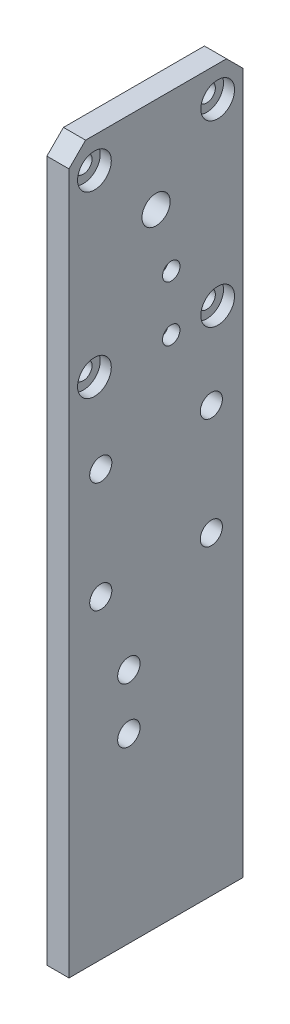
ISO-10303-21;
HEADER;
FILE_DESCRIPTION(('STEP AP214'),'2;1');
FILE_NAME('part.step','',(''),(''),'','','');
FILE_SCHEMA(('AUTOMOTIVE_DESIGN { 1 0 10303 214 1 1 1 1 }'));
ENDSEC;
DATA;
#1=APPLICATION_CONTEXT('core data for automotive mechanical design processes');
#2=APPLICATION_PROTOCOL_DEFINITION('international standard','automotive_design',2000,#1);
#3=PRODUCT_CONTEXT('',#1,'mechanical');
#4=PRODUCT('Part','Part','',(#3));
#5=PRODUCT_RELATED_PRODUCT_CATEGORY('part','',(#4));
#6=PRODUCT_DEFINITION_FORMATION('','',#4);
#7=PRODUCT_DEFINITION_CONTEXT('part definition',#1,'design');
#8=PRODUCT_DEFINITION('design','',#6,#7);
#9=PRODUCT_DEFINITION_SHAPE('','',#8);
#10=(LENGTH_UNIT() NAMED_UNIT(*) SI_UNIT(.MILLI.,.METRE.));
#11=(NAMED_UNIT(*) PLANE_ANGLE_UNIT() SI_UNIT($,.RADIAN.));
#12=(NAMED_UNIT(*) SI_UNIT($,.STERADIAN.) SOLID_ANGLE_UNIT());
#13=UNCERTAINTY_MEASURE_WITH_UNIT(LENGTH_MEASURE(1.E-05),#10,'distance_accuracy_value','');
#14=(GEOMETRIC_REPRESENTATION_CONTEXT(3) GLOBAL_UNCERTAINTY_ASSIGNED_CONTEXT((#13)) GLOBAL_UNIT_ASSIGNED_CONTEXT((#10,
#11,#12)) REPRESENTATION_CONTEXT('',''));
#15=CARTESIAN_POINT('',(0.,0.,0.));
#16=DIRECTION('',(0.,0.,1.));
#17=DIRECTION('',(1.,0.,0.));
#18=AXIS2_PLACEMENT_3D('',#15,#16,#17);
#19=CARTESIAN_POINT('',(0.,25.1,11.15));
#20=DIRECTION('',(1.,0.,0.));
#21=DIRECTION('',(0.,0.,-1.));
#22=AXIS2_PLACEMENT_3D('',#19,#20,#21);
#23=CYLINDRICAL_SURFACE('',#22,1.575);
#24=CARTESIAN_POINT('',(0.,25.1,11.15));
#25=DIRECTION('',(1.,0.,0.));
#26=DIRECTION('',(0.,0.,-1.));
#27=AXIS2_PLACEMENT_3D('',#24,#25,#26);
#28=CIRCLE('',#27,1.575);
#29=CARTESIAN_POINT('',(0.,25.1,9.57499999999999));
#30=VERTEX_POINT('',#29);
#31=EDGE_CURVE('E163',#30,#30,#28,.T.);
#32=ORIENTED_EDGE('',*,*,#31,.F.);
#33=EDGE_LOOP('',(#32));
#34=FACE_BOUND('',#33,.T.);
#35=CARTESIAN_POINT('',(2.,25.1,11.15));
#36=DIRECTION('',(1.,0.,0.));
#37=DIRECTION('',(0.,0.,-1.));
#38=AXIS2_PLACEMENT_3D('',#35,#36,#37);
#39=CIRCLE('',#38,1.575);
#40=CARTESIAN_POINT('',(2.,25.1,9.57499999999999));
#41=VERTEX_POINT('',#40);
#42=EDGE_CURVE('E37',#41,#41,#39,.F.);
#43=ORIENTED_EDGE('',*,*,#42,.F.);
#44=EDGE_LOOP('',(#43));
#45=FACE_BOUND('',#44,.T.);
#46=ADVANCED_FACE('F33',(#34,#45),#23,.F.);
#47=CARTESIAN_POINT('',(0.,25.1,-11.15));
#48=DIRECTION('',(1.,0.,0.));
#49=DIRECTION('',(0.,0.,-1.));
#50=AXIS2_PLACEMENT_3D('',#47,#48,#49);
#51=CYLINDRICAL_SURFACE('',#50,1.575);
#52=CARTESIAN_POINT('',(0.,25.1,-11.15));
#53=DIRECTION('',(1.,0.,0.));
#54=DIRECTION('',(0.,0.,-1.));
#55=AXIS2_PLACEMENT_3D('',#52,#53,#54);
#56=CIRCLE('',#55,1.575);
#57=CARTESIAN_POINT('',(0.,25.1,-12.725));
#58=VERTEX_POINT('',#57);
#59=EDGE_CURVE('E160',#58,#58,#56,.T.);
#60=ORIENTED_EDGE('',*,*,#59,.F.);
#61=EDGE_LOOP('',(#60));
#62=FACE_BOUND('',#61,.T.);
#63=CARTESIAN_POINT('',(2.,25.1,-11.15));
#64=DIRECTION('',(1.,0.,0.));
#65=DIRECTION('',(0.,0.,-1.));
#66=AXIS2_PLACEMENT_3D('',#63,#64,#65);
#67=CIRCLE('',#66,1.575);
#68=CARTESIAN_POINT('',(2.,25.1,-12.725));
#69=VERTEX_POINT('',#68);
#70=EDGE_CURVE('E128',#69,#69,#67,.F.);
#71=ORIENTED_EDGE('',*,*,#70,.F.);
#72=EDGE_LOOP('',(#71));
#73=FACE_BOUND('',#72,.T.);
#74=ADVANCED_FACE('F239',(#62,#73),#51,.F.);
#75=CARTESIAN_POINT('',(0.,57.45,-11.15));
#76=DIRECTION('',(1.,0.,0.));
#77=DIRECTION('',(0.,0.,-1.));
#78=AXIS2_PLACEMENT_3D('',#75,#76,#77);
#79=CYLINDRICAL_SURFACE('',#78,1.575);
#80=CARTESIAN_POINT('',(0.,57.45,-11.15));
#81=DIRECTION('',(1.,0.,0.));
#82=DIRECTION('',(0.,0.,-1.));
#83=AXIS2_PLACEMENT_3D('',#80,#81,#82);
#84=CIRCLE('',#83,1.575);
#85=CARTESIAN_POINT('',(0.,57.45,-12.725));
#86=VERTEX_POINT('',#85);
#87=EDGE_CURVE('E166',#86,#86,#84,.T.);
#88=ORIENTED_EDGE('',*,*,#87,.F.);
#89=EDGE_LOOP('',(#88));
#90=FACE_BOUND('',#89,.T.);
#91=CARTESIAN_POINT('',(2.,57.45,-11.15));
#92=DIRECTION('',(1.,0.,0.));
#93=DIRECTION('',(0.,0.,-1.));
#94=AXIS2_PLACEMENT_3D('',#91,#92,#93);
#95=CIRCLE('',#94,1.575);
#96=CARTESIAN_POINT('',(2.,57.45,-12.725));
#97=VERTEX_POINT('',#96);
#98=EDGE_CURVE('E135',#97,#97,#95,.F.);
#99=ORIENTED_EDGE('',*,*,#98,.F.);
#100=EDGE_LOOP('',(#99));
#101=FACE_BOUND('',#100,.T.);
#102=ADVANCED_FACE('F241',(#90,#101),#79,.F.);
#103=CARTESIAN_POINT('',(0.,57.45,11.15));
#104=DIRECTION('',(1.,0.,0.));
#105=DIRECTION('',(0.,0.,-1.));
#106=AXIS2_PLACEMENT_3D('',#103,#104,#105);
#107=CYLINDRICAL_SURFACE('',#106,1.575);
#108=CARTESIAN_POINT('',(0.,57.45,11.15));
#109=DIRECTION('',(1.,0.,0.));
#110=DIRECTION('',(0.,0.,-1.));
#111=AXIS2_PLACEMENT_3D('',#108,#109,#110);
#112=CIRCLE('',#111,1.575);
#113=CARTESIAN_POINT('',(0.,57.45,9.57499999999999));
#114=VERTEX_POINT('',#113);
#115=EDGE_CURVE('E169',#114,#114,#112,.T.);
#116=ORIENTED_EDGE('',*,*,#115,.F.);
#117=EDGE_LOOP('',(#116));
#118=FACE_BOUND('',#117,.T.);
#119=CARTESIAN_POINT('',(2.,57.45,11.15));
#120=DIRECTION('',(1.,0.,0.));
#121=DIRECTION('',(0.,0.,-1.));
#122=AXIS2_PLACEMENT_3D('',#119,#120,#121);
#123=CIRCLE('',#122,1.575);
#124=CARTESIAN_POINT('',(2.,57.45,9.57499999999999));
#125=VERTEX_POINT('',#124);
#126=EDGE_CURVE('E142',#125,#125,#123,.F.);
#127=ORIENTED_EDGE('',*,*,#126,.F.);
#128=EDGE_LOOP('',(#127));
#129=FACE_BOUND('',#128,.T.);
#130=ADVANCED_FACE('F248',(#118,#129),#107,.F.);
#131=CARTESIAN_POINT('',(0.,34.75,-2.75000000000001));
#132=DIRECTION('',(1.,0.,0.));
#133=DIRECTION('',(0.,0.,-1.));
#134=AXIS2_PLACEMENT_3D('',#131,#132,#133);
#135=CYLINDRICAL_SURFACE('',#134,1.575);
#136=CARTESIAN_POINT('',(4.,34.75,-2.75000000000001));
#137=DIRECTION('',(1.,0.,0.));
#138=DIRECTION('',(0.,0.,-1.));
#139=AXIS2_PLACEMENT_3D('',#136,#137,#138);
#140=CIRCLE('',#139,1.575);
#141=CARTESIAN_POINT('',(4.,34.75,-4.32500000000001));
#142=VERTEX_POINT('',#141);
#143=EDGE_CURVE('E175',#142,#142,#140,.T.);
#144=ORIENTED_EDGE('',*,*,#143,.T.);
#145=EDGE_LOOP('',(#144));
#146=FACE_BOUND('',#145,.T.);
#147=CARTESIAN_POINT('',(1.9,34.75,-2.75000000000001));
#148=DIRECTION('',(-1.,0.,0.));
#149=DIRECTION('',(0.,0.,1.));
#150=AXIS2_PLACEMENT_3D('',#147,#148,#149);
#151=CIRCLE('',#150,1.575);
#152=CARTESIAN_POINT('',(1.9,34.75,-1.17500000000001));
#153=VERTEX_POINT('',#152);
#154=EDGE_CURVE('E149',#153,#153,#151,.F.);
#155=ORIENTED_EDGE('',*,*,#154,.F.);
#156=EDGE_LOOP('',(#155));
#157=FACE_BOUND('',#156,.T.);
#158=ADVANCED_FACE('F260',(#146,#157),#135,.F.);
#159=CARTESIAN_POINT('',(0.,24.75,-2.75000000000001));
#160=DIRECTION('',(1.,0.,0.));
#161=DIRECTION('',(0.,0.,-1.));
#162=AXIS2_PLACEMENT_3D('',#159,#160,#161);
#163=CYLINDRICAL_SURFACE('',#162,1.575);
#164=CARTESIAN_POINT('',(4.,24.75,-2.75000000000001));
#165=DIRECTION('',(1.,0.,0.));
#166=DIRECTION('',(0.,0.,-1.));
#167=AXIS2_PLACEMENT_3D('',#164,#165,#166);
#168=CIRCLE('',#167,1.575);
#169=CARTESIAN_POINT('',(4.,24.75,-4.32500000000001));
#170=VERTEX_POINT('',#169);
#171=EDGE_CURVE('E172',#170,#170,#168,.T.);
#172=ORIENTED_EDGE('',*,*,#171,.T.);
#173=EDGE_LOOP('',(#172));
#174=FACE_BOUND('',#173,.T.);
#175=CARTESIAN_POINT('',(1.9,24.75,-2.75000000000001));
#176=DIRECTION('',(-1.,0.,0.));
#177=DIRECTION('',(0.,0.,1.));
#178=AXIS2_PLACEMENT_3D('',#175,#176,#177);
#179=CIRCLE('',#178,1.575);
#180=CARTESIAN_POINT('',(1.9,24.75,-1.17500000000001));
#181=VERTEX_POINT('',#180);
#182=EDGE_CURVE('E156',#181,#181,#179,.F.);
#183=ORIENTED_EDGE('',*,*,#182,.F.);
#184=EDGE_LOOP('',(#183));
#185=FACE_BOUND('',#184,.T.);
#186=ADVANCED_FACE('F262',(#174,#185),#163,.F.);
#187=CARTESIAN_POINT('',(4.,-63.,-15.75));
#188=DIRECTION('',(0.,0.,1.));
#189=DIRECTION('',(1.,0.,0.));
#190=AXIS2_PLACEMENT_3D('',#187,#188,#189);
#191=PLANE('',#190);
#192=DIRECTION('',(0.,1.,0.));
#193=VECTOR('',#192,1.);
#194=CARTESIAN_POINT('',(0.,-63.,-15.75));
#195=LINE('',#194,#193);
#196=CARTESIAN_POINT('',(0.,-66.76,-15.75));
#197=VERTEX_POINT('',#196);
#198=CARTESIAN_POINT('',(0.,60.,-15.75));
#199=VERTEX_POINT('',#198);
#200=EDGE_CURVE('E89',#197,#199,#195,.T.);
#201=ORIENTED_EDGE('',*,*,#200,.T.);
#202=DIRECTION('',(1.,0.,0.));
#203=VECTOR('',#202,1.);
#204=CARTESIAN_POINT('',(4.,60.,-15.75));
#205=LINE('',#204,#203);
#206=CARTESIAN_POINT('',(4.,60.,-15.75));
#207=VERTEX_POINT('',#206);
#208=EDGE_CURVE('E58',#199,#207,#205,.T.);
#209=ORIENTED_EDGE('',*,*,#208,.T.);
#210=DIRECTION('',(0.,1.,0.));
#211=VECTOR('',#210,1.);
#212=CARTESIAN_POINT('',(4.,-63.,-15.75));
#213=LINE('',#212,#211);
#214=CARTESIAN_POINT('',(4.,-66.76,-15.75));
#215=VERTEX_POINT('',#214);
#216=EDGE_CURVE('E104',#215,#207,#213,.T.);
#217=ORIENTED_EDGE('',*,*,#216,.F.);
#218=DIRECTION('',(1.,0.,0.));
#219=VECTOR('',#218,1.);
#220=CARTESIAN_POINT('',(-31.7236126568208,-66.76,-15.75));
#221=LINE('',#220,#219);
#222=EDGE_CURVE('E102',#197,#215,#221,.T.);
#223=ORIENTED_EDGE('',*,*,#222,.F.);
#224=EDGE_LOOP('',(#201,#209,#217,#223));
#225=FACE_BOUND('',#224,.T.);
#226=ADVANCED_FACE('F103',(#225),#191,.F.);
#227=CARTESIAN_POINT('',(4.,63.,15.75));
#228=DIRECTION('',(0.,-1.,0.));
#229=DIRECTION('',(0.,0.,-1.));
#230=AXIS2_PLACEMENT_3D('',#227,#228,#229);
#231=PLANE('',#230);
#232=DIRECTION('',(0.,0.,1.));
#233=VECTOR('',#232,1.);
#234=CARTESIAN_POINT('',(4.,63.,15.75));
#235=LINE('',#234,#233);
#236=CARTESIAN_POINT('',(4.,63.,-12.75));
#237=VERTEX_POINT('',#236);
#238=CARTESIAN_POINT('',(4.,63.,12.75));
#239=VERTEX_POINT('',#238);
#240=EDGE_CURVE('E208',#237,#239,#235,.T.);
#241=ORIENTED_EDGE('',*,*,#240,.F.);
#242=DIRECTION('',(-1.,0.,0.));
#243=VECTOR('',#242,1.);
#244=CARTESIAN_POINT('',(4.,63.,-12.75));
#245=LINE('',#244,#243);
#246=CARTESIAN_POINT('',(0.,63.,-12.75));
#247=VERTEX_POINT('',#246);
#248=EDGE_CURVE('E218',#237,#247,#245,.T.);
#249=ORIENTED_EDGE('',*,*,#248,.T.);
#250=DIRECTION('',(0.,0.,1.));
#251=VECTOR('',#250,1.);
#252=CARTESIAN_POINT('',(0.,63.,15.75));
#253=LINE('',#252,#251);
#254=CARTESIAN_POINT('',(0.,63.,12.75));
#255=VERTEX_POINT('',#254);
#256=EDGE_CURVE('E98',#247,#255,#253,.T.);
#257=ORIENTED_EDGE('',*,*,#256,.T.);
#258=DIRECTION('',(1.,0.,0.));
#259=VECTOR('',#258,1.);
#260=CARTESIAN_POINT('',(4.,63.,12.75));
#261=LINE('',#260,#259);
#262=EDGE_CURVE('E212',#255,#239,#261,.T.);
#263=ORIENTED_EDGE('',*,*,#262,.T.);
#264=EDGE_LOOP('',(#241,#249,#257,#263));
#265=FACE_BOUND('',#264,.T.);
#266=ADVANCED_FACE('F300',(#265),#231,.F.);
#267=CARTESIAN_POINT('',(4.,-63.,15.75));
#268=DIRECTION('',(0.,0.,-1.));
#269=DIRECTION('',(-1.,0.,0.));
#270=AXIS2_PLACEMENT_3D('',#267,#268,#269);
#271=PLANE('',#270);
#272=DIRECTION('',(0.,-1.,0.));
#273=VECTOR('',#272,1.);
#274=CARTESIAN_POINT('',(4.,-63.,15.75));
#275=LINE('',#274,#273);
#276=CARTESIAN_POINT('',(4.,60.,15.75));
#277=VERTEX_POINT('',#276);
#278=CARTESIAN_POINT('',(4.,-66.76,15.75));
#279=VERTEX_POINT('',#278);
#280=EDGE_CURVE('E211',#277,#279,#275,.T.);
#281=ORIENTED_EDGE('',*,*,#280,.F.);
#282=DIRECTION('',(-1.,0.,0.));
#283=VECTOR('',#282,1.);
#284=CARTESIAN_POINT('',(4.,60.,15.75));
#285=LINE('',#284,#283);
#286=CARTESIAN_POINT('',(0.,60.,15.75));
#287=VERTEX_POINT('',#286);
#288=EDGE_CURVE('E11',#277,#287,#285,.T.);
#289=ORIENTED_EDGE('',*,*,#288,.T.);
#290=DIRECTION('',(0.,-1.,0.));
#291=VECTOR('',#290,1.);
#292=CARTESIAN_POINT('',(0.,-63.,15.75));
#293=LINE('',#292,#291);
#294=CARTESIAN_POINT('',(0.,-66.76,15.75));
#295=VERTEX_POINT('',#294);
#296=EDGE_CURVE('E209',#287,#295,#293,.T.);
#297=ORIENTED_EDGE('',*,*,#296,.T.);
#298=DIRECTION('',(1.,0.,0.));
#299=VECTOR('',#298,1.);
#300=CARTESIAN_POINT('',(-31.7236126568208,-66.76,15.75));
#301=LINE('',#300,#299);
#302=EDGE_CURVE('E108',#295,#279,#301,.T.);
#303=ORIENTED_EDGE('',*,*,#302,.T.);
#304=EDGE_LOOP('',(#281,#289,#297,#303));
#305=FACE_BOUND('',#304,.T.);
#306=ADVANCED_FACE('F293',(#305),#271,.F.);
#307=CARTESIAN_POINT('',(4.,0.,0.));
#308=DIRECTION('',(-1.,0.,0.));
#309=DIRECTION('',(0.,0.,1.));
#310=AXIS2_PLACEMENT_3D('',#307,#308,#309);
#311=PLANE('',#310);
#312=CARTESIAN_POINT('',(4.,-33.8912800918103,4.91726188957796));
#313=DIRECTION('',(1.,0.,0.));
#314=DIRECTION('',(0.,0.,-1.));
#315=AXIS2_PLACEMENT_3D('',#312,#313,#314);
#316=CIRCLE('',#315,2.025);
#317=CARTESIAN_POINT('',(4.,-33.8912800918103,2.89226188957796));
#318=VERTEX_POINT('',#317);
#319=EDGE_CURVE('E384',#318,#318,#316,.T.);
#320=ORIENTED_EDGE('',*,*,#319,.F.);
#321=EDGE_LOOP('',(#320));
#322=FACE_BOUND('',#321,.T.);
#323=CARTESIAN_POINT('',(4.,-23.8912800918103,4.91726188957796));
#324=DIRECTION('',(1.,0.,0.));
#325=DIRECTION('',(0.,0.,-1.));
#326=AXIS2_PLACEMENT_3D('',#323,#324,#325);
#327=CIRCLE('',#326,2.02500000000016);
#328=CARTESIAN_POINT('',(4.,-23.8912800918103,2.8922618895778));
#329=VERTEX_POINT('',#328);
#330=EDGE_CURVE('E386',#329,#329,#327,.T.);
#331=ORIENTED_EDGE('',*,*,#330,.F.);
#332=EDGE_LOOP('',(#331));
#333=FACE_BOUND('',#332,.T.);
#334=CARTESIAN_POINT('',(4.,25.1,11.15));
#335=DIRECTION('',(1.,0.,0.));
#336=DIRECTION('',(0.,0.,-1.));
#337=AXIS2_PLACEMENT_3D('',#334,#335,#336);
#338=CIRCLE('',#337,3.05);
#339=CARTESIAN_POINT('',(4.,25.1,8.09999999999999));
#340=VERTEX_POINT('',#339);
#341=EDGE_CURVE('E119',#340,#340,#338,.T.);
#342=ORIENTED_EDGE('',*,*,#341,.F.);
#343=EDGE_LOOP('',(#342));
#344=FACE_BOUND('',#343,.T.);
#345=CARTESIAN_POINT('',(4.,25.1,-11.15));
#346=DIRECTION('',(1.,0.,0.));
#347=DIRECTION('',(0.,0.,-1.));
#348=AXIS2_PLACEMENT_3D('',#345,#346,#347);
#349=CIRCLE('',#348,3.05);
#350=CARTESIAN_POINT('',(4.,25.1,-14.2));
#351=VERTEX_POINT('',#350);
#352=EDGE_CURVE('E129',#351,#351,#349,.T.);
#353=ORIENTED_EDGE('',*,*,#352,.F.);
#354=EDGE_LOOP('',(#353));
#355=FACE_BOUND('',#354,.T.);
#356=CARTESIAN_POINT('',(4.,57.45,-11.15));
#357=DIRECTION('',(1.,0.,0.));
#358=DIRECTION('',(0.,0.,-1.));
#359=AXIS2_PLACEMENT_3D('',#356,#357,#358);
#360=CIRCLE('',#359,3.04999999999999);
#361=CARTESIAN_POINT('',(4.,57.45,-14.2));
#362=VERTEX_POINT('',#361);
#363=EDGE_CURVE('E136',#362,#362,#360,.T.);
#364=ORIENTED_EDGE('',*,*,#363,.F.);
#365=EDGE_LOOP('',(#364));
#366=FACE_BOUND('',#365,.T.);
#367=CARTESIAN_POINT('',(4.,57.45,11.15));
#368=DIRECTION('',(1.,0.,0.));
#369=DIRECTION('',(0.,0.,-1.));
#370=AXIS2_PLACEMENT_3D('',#367,#368,#369);
#371=CIRCLE('',#370,3.04999999999999);
#372=CARTESIAN_POINT('',(4.,57.45,8.1));
#373=VERTEX_POINT('',#372);
#374=EDGE_CURVE('E143',#373,#373,#371,.T.);
#375=ORIENTED_EDGE('',*,*,#374,.F.);
#376=EDGE_LOOP('',(#375));
#377=FACE_BOUND('',#376,.T.);
#378=ORIENTED_EDGE('',*,*,#171,.F.);
#379=EDGE_LOOP('',(#378));
#380=FACE_BOUND('',#379,.T.);
#381=ORIENTED_EDGE('',*,*,#143,.F.);
#382=EDGE_LOOP('',(#381));
#383=FACE_BOUND('',#382,.T.);
#384=CARTESIAN_POINT('',(4.,45.75,0.));
#385=DIRECTION('',(-1.,0.,0.));
#386=DIRECTION('',(0.,0.,1.));
#387=AXIS2_PLACEMENT_3D('',#384,#385,#386);
#388=CIRCLE('',#387,2.54999999999999);
#389=CARTESIAN_POINT('',(4.,45.75,2.54999999999999));
#390=VERTEX_POINT('',#389);
#391=EDGE_CURVE('E179',#390,#390,#388,.T.);
#392=ORIENTED_EDGE('',*,*,#391,.T.);
#393=EDGE_LOOP('',(#392));
#394=FACE_BOUND('',#393,.T.);
#395=CARTESIAN_POINT('',(4.,-9.90000000000001,-10.));
#396=DIRECTION('',(1.,0.,0.));
#397=DIRECTION('',(0.,0.,-1.));
#398=AXIS2_PLACEMENT_3D('',#395,#396,#397);
#399=CIRCLE('',#398,2.00000000000001);
#400=CARTESIAN_POINT('',(4.,-9.90000000000001,-12.));
#401=VERTEX_POINT('',#400);
#402=EDGE_CURVE('E182',#401,#401,#399,.T.);
#403=ORIENTED_EDGE('',*,*,#402,.F.);
#404=EDGE_LOOP('',(#403));
#405=FACE_BOUND('',#404,.T.);
#406=CARTESIAN_POINT('',(4.,-9.90000000000001,10.));
#407=DIRECTION('',(1.,0.,0.));
#408=DIRECTION('',(0.,0.,-1.));
#409=AXIS2_PLACEMENT_3D('',#406,#407,#408);
#410=CIRCLE('',#409,2.);
#411=CARTESIAN_POINT('',(4.,-9.90000000000001,8.));
#412=VERTEX_POINT('',#411);
#413=EDGE_CURVE('E188',#412,#412,#410,.T.);
#414=ORIENTED_EDGE('',*,*,#413,.F.);
#415=EDGE_LOOP('',(#414));
#416=FACE_BOUND('',#415,.T.);
#417=CARTESIAN_POINT('',(4.,10.1,-10.));
#418=DIRECTION('',(1.,0.,0.));
#419=DIRECTION('',(0.,0.,-1.));
#420=AXIS2_PLACEMENT_3D('',#417,#418,#419);
#421=CIRCLE('',#420,2.00000000000001);
#422=CARTESIAN_POINT('',(4.,10.1,-12.));
#423=VERTEX_POINT('',#422);
#424=EDGE_CURVE('E194',#423,#423,#421,.T.);
#425=ORIENTED_EDGE('',*,*,#424,.F.);
#426=EDGE_LOOP('',(#425));
#427=FACE_BOUND('',#426,.T.);
#428=CARTESIAN_POINT('',(4.,10.1,10.));
#429=DIRECTION('',(1.,0.,0.));
#430=DIRECTION('',(0.,0.,-1.));
#431=AXIS2_PLACEMENT_3D('',#428,#429,#430);
#432=CIRCLE('',#431,2.);
#433=CARTESIAN_POINT('',(4.,10.1,8.));
#434=VERTEX_POINT('',#433);
#435=EDGE_CURVE('E200',#434,#434,#432,.T.);
#436=ORIENTED_EDGE('',*,*,#435,.F.);
#437=EDGE_LOOP('',(#436));
#438=FACE_BOUND('',#437,.T.);
#439=ORIENTED_EDGE('',*,*,#216,.T.);
#440=DIRECTION('',(0.,-0.707106781186548,-0.707106781186548));
#441=VECTOR('',#440,1.);
#442=CARTESIAN_POINT('',(4.,63.,-12.75));
#443=LINE('',#442,#441);
#444=EDGE_CURVE('E42',#207,#237,#443,.F.);
#445=ORIENTED_EDGE('',*,*,#444,.T.);
#446=ORIENTED_EDGE('',*,*,#240,.T.);
#447=DIRECTION('',(0.,0.707106781186546,-0.707106781186549));
#448=VECTOR('',#447,1.);
#449=CARTESIAN_POINT('',(4.,60.,15.75));
#450=LINE('',#449,#448);
#451=EDGE_CURVE('E50',#239,#277,#450,.F.);
#452=ORIENTED_EDGE('',*,*,#451,.T.);
#453=ORIENTED_EDGE('',*,*,#280,.T.);
#454=DIRECTION('',(0.,0.,-1.));
#455=VECTOR('',#454,1.);
#456=CARTESIAN_POINT('',(4.,-66.76,15.75));
#457=LINE('',#456,#455);
#458=EDGE_CURVE('E112',#279,#215,#457,.T.);
#459=ORIENTED_EDGE('',*,*,#458,.T.);
#460=EDGE_LOOP('',(#439,#445,#446,#452,#453,#459));
#461=FACE_BOUND('',#460,.T.);
#462=ADVANCED_FACE('F290',(#322,#333,#344,#355,#366,#377,#380,#383,#394,#405,#416,#427,#438,
#461),#311,.F.);
#463=CARTESIAN_POINT('',(0.,0.,0.));
#464=DIRECTION('',(-1.,0.,0.));
#465=DIRECTION('',(0.,0.,1.));
#466=AXIS2_PLACEMENT_3D('',#463,#464,#465);
#467=PLANE('',#466);
#468=CARTESIAN_POINT('',(0.,-33.8912800918103,4.91726188957796));
#469=DIRECTION('',(1.,0.,0.));
#470=DIRECTION('',(0.,0.,-1.));
#471=AXIS2_PLACEMENT_3D('',#468,#469,#470);
#472=CIRCLE('',#471,2.025);
#473=CARTESIAN_POINT('',(0.,-33.8912800918103,2.89226188957796));
#474=VERTEX_POINT('',#473);
#475=EDGE_CURVE('E381',#474,#474,#472,.T.);
#476=ORIENTED_EDGE('',*,*,#475,.T.);
#477=EDGE_LOOP('',(#476));
#478=FACE_BOUND('',#477,.T.);
#479=CARTESIAN_POINT('',(0.,-23.8912800918103,4.91726188957796));
#480=DIRECTION('',(1.,0.,0.));
#481=DIRECTION('',(0.,0.,-1.));
#482=AXIS2_PLACEMENT_3D('',#479,#480,#481);
#483=CIRCLE('',#482,2.02500000000016);
#484=CARTESIAN_POINT('',(0.,-23.8912800918103,2.8922618895778));
#485=VERTEX_POINT('',#484);
#486=EDGE_CURVE('E114',#485,#485,#483,.T.);
#487=ORIENTED_EDGE('',*,*,#486,.T.);
#488=EDGE_LOOP('',(#487));
#489=FACE_BOUND('',#488,.T.);
#490=CARTESIAN_POINT('',(0.,34.75,-2.75000000000001));
#491=DIRECTION('',(-1.,0.,0.));
#492=DIRECTION('',(0.,0.,1.));
#493=AXIS2_PLACEMENT_3D('',#490,#491,#492);
#494=CIRCLE('',#493,3.50000000000001);
#495=CARTESIAN_POINT('',(0.,34.75,0.750000000000001));
#496=VERTEX_POINT('',#495);
#497=EDGE_CURVE('E150',#496,#496,#494,.T.);
#498=ORIENTED_EDGE('',*,*,#497,.F.);
#499=EDGE_LOOP('',(#498));
#500=FACE_BOUND('',#499,.T.);
#501=CARTESIAN_POINT('',(0.,24.75,-2.75000000000001));
#502=DIRECTION('',(-1.,0.,0.));
#503=DIRECTION('',(0.,0.,1.));
#504=AXIS2_PLACEMENT_3D('',#501,#502,#503);
#505=CIRCLE('',#504,3.5);
#506=CARTESIAN_POINT('',(0.,24.75,0.74999999999999));
#507=VERTEX_POINT('',#506);
#508=EDGE_CURVE('E157',#507,#507,#505,.T.);
#509=ORIENTED_EDGE('',*,*,#508,.F.);
#510=EDGE_LOOP('',(#509));
#511=FACE_BOUND('',#510,.T.);
#512=ORIENTED_EDGE('',*,*,#59,.T.);
#513=EDGE_LOOP('',(#512));
#514=FACE_BOUND('',#513,.T.);
#515=ORIENTED_EDGE('',*,*,#31,.T.);
#516=EDGE_LOOP('',(#515));
#517=FACE_BOUND('',#516,.T.);
#518=ORIENTED_EDGE('',*,*,#87,.T.);
#519=EDGE_LOOP('',(#518));
#520=FACE_BOUND('',#519,.T.);
#521=ORIENTED_EDGE('',*,*,#115,.T.);
#522=EDGE_LOOP('',(#521));
#523=FACE_BOUND('',#522,.T.);
#524=CARTESIAN_POINT('',(0.,45.75,0.));
#525=DIRECTION('',(-1.,0.,0.));
#526=DIRECTION('',(0.,0.,1.));
#527=AXIS2_PLACEMENT_3D('',#524,#525,#526);
#528=CIRCLE('',#527,2.54999999999999);
#529=CARTESIAN_POINT('',(0.,45.75,2.54999999999999));
#530=VERTEX_POINT('',#529);
#531=EDGE_CURVE('E178',#530,#530,#528,.T.);
#532=ORIENTED_EDGE('',*,*,#531,.F.);
#533=EDGE_LOOP('',(#532));
#534=FACE_BOUND('',#533,.T.);
#535=CARTESIAN_POINT('',(0.,-9.90000000000001,-10.));
#536=DIRECTION('',(1.,0.,0.));
#537=DIRECTION('',(0.,0.,-1.));
#538=AXIS2_PLACEMENT_3D('',#535,#536,#537);
#539=CIRCLE('',#538,2.00000000000001);
#540=CARTESIAN_POINT('',(0.,-9.90000000000001,-12.));
#541=VERTEX_POINT('',#540);
#542=EDGE_CURVE('E185',#541,#541,#539,.T.);
#543=ORIENTED_EDGE('',*,*,#542,.T.);
#544=EDGE_LOOP('',(#543));
#545=FACE_BOUND('',#544,.T.);
#546=CARTESIAN_POINT('',(0.,-9.90000000000001,10.));
#547=DIRECTION('',(1.,0.,0.));
#548=DIRECTION('',(0.,0.,-1.));
#549=AXIS2_PLACEMENT_3D('',#546,#547,#548);
#550=CIRCLE('',#549,2.);
#551=CARTESIAN_POINT('',(0.,-9.90000000000001,8.));
#552=VERTEX_POINT('',#551);
#553=EDGE_CURVE('E191',#552,#552,#550,.T.);
#554=ORIENTED_EDGE('',*,*,#553,.T.);
#555=EDGE_LOOP('',(#554));
#556=FACE_BOUND('',#555,.T.);
#557=CARTESIAN_POINT('',(0.,10.1,-10.));
#558=DIRECTION('',(1.,0.,0.));
#559=DIRECTION('',(0.,0.,-1.));
#560=AXIS2_PLACEMENT_3D('',#557,#558,#559);
#561=CIRCLE('',#560,2.00000000000001);
#562=CARTESIAN_POINT('',(0.,10.1,-12.));
#563=VERTEX_POINT('',#562);
#564=EDGE_CURVE('E197',#563,#563,#561,.T.);
#565=ORIENTED_EDGE('',*,*,#564,.T.);
#566=EDGE_LOOP('',(#565));
#567=FACE_BOUND('',#566,.T.);
#568=CARTESIAN_POINT('',(0.,10.1,10.));
#569=DIRECTION('',(1.,0.,0.));
#570=DIRECTION('',(0.,0.,-1.));
#571=AXIS2_PLACEMENT_3D('',#568,#569,#570);
#572=CIRCLE('',#571,2.);
#573=CARTESIAN_POINT('',(0.,10.1,8.));
#574=VERTEX_POINT('',#573);
#575=EDGE_CURVE('E99',#574,#574,#572,.T.);
#576=ORIENTED_EDGE('',*,*,#575,.T.);
#577=EDGE_LOOP('',(#576));
#578=FACE_BOUND('',#577,.T.);
#579=ORIENTED_EDGE('',*,*,#256,.F.);
#580=DIRECTION('',(0.,0.707106781186548,0.707106781186548));
#581=VECTOR('',#580,1.);
#582=CARTESIAN_POINT('',(0.,37.875,-37.875));
#583=LINE('',#582,#581);
#584=EDGE_CURVE('E97',#247,#199,#583,.F.);
#585=ORIENTED_EDGE('',*,*,#584,.T.);
#586=ORIENTED_EDGE('',*,*,#200,.F.);
#587=DIRECTION('',(0.,0.,-1.));
#588=VECTOR('',#587,1.);
#589=CARTESIAN_POINT('',(0.,-66.76,15.75));
#590=LINE('',#589,#588);
#591=EDGE_CURVE('E95',#295,#197,#590,.T.);
#592=ORIENTED_EDGE('',*,*,#591,.F.);
#593=ORIENTED_EDGE('',*,*,#296,.F.);
#594=DIRECTION('',(0.,-0.707106781186546,0.707106781186549));
#595=VECTOR('',#594,1.);
#596=CARTESIAN_POINT('',(0.,37.8750000000001,37.875));
#597=LINE('',#596,#595);
#598=EDGE_CURVE('E221',#287,#255,#597,.F.);
#599=ORIENTED_EDGE('',*,*,#598,.T.);
#600=EDGE_LOOP('',(#579,#585,#586,#592,#593,#599));
#601=FACE_BOUND('',#600,.T.);
#602=ADVANCED_FACE('F92',(#478,#489,#500,#511,#514,#517,#520,#523,#534,#545,#556,#567,#578,
#601),#467,.T.);
#603=CARTESIAN_POINT('',(0.,10.1,10.));
#604=DIRECTION('',(1.,0.,0.));
#605=DIRECTION('',(0.,0.,-1.));
#606=AXIS2_PLACEMENT_3D('',#603,#604,#605);
#607=CYLINDRICAL_SURFACE('',#606,2.);
#608=ORIENTED_EDGE('',*,*,#575,.F.);
#609=EDGE_LOOP('',(#608));
#610=FACE_BOUND('',#609,.T.);
#611=ORIENTED_EDGE('',*,*,#435,.T.);
#612=EDGE_LOOP('',(#611));
#613=FACE_BOUND('',#612,.T.);
#614=ADVANCED_FACE('F285',(#610,#613),#607,.F.);
#615=CARTESIAN_POINT('',(0.,10.1,-10.));
#616=DIRECTION('',(1.,0.,0.));
#617=DIRECTION('',(0.,0.,-1.));
#618=AXIS2_PLACEMENT_3D('',#615,#616,#617);
#619=CYLINDRICAL_SURFACE('',#618,2.00000000000001);
#620=ORIENTED_EDGE('',*,*,#564,.F.);
#621=EDGE_LOOP('',(#620));
#622=FACE_BOUND('',#621,.T.);
#623=ORIENTED_EDGE('',*,*,#424,.T.);
#624=EDGE_LOOP('',(#623));
#625=FACE_BOUND('',#624,.T.);
#626=ADVANCED_FACE('F281',(#622,#625),#619,.F.);
#627=CARTESIAN_POINT('',(0.,-9.90000000000001,10.));
#628=DIRECTION('',(1.,0.,0.));
#629=DIRECTION('',(0.,0.,-1.));
#630=AXIS2_PLACEMENT_3D('',#627,#628,#629);
#631=CYLINDRICAL_SURFACE('',#630,2.);
#632=ORIENTED_EDGE('',*,*,#553,.F.);
#633=EDGE_LOOP('',(#632));
#634=FACE_BOUND('',#633,.T.);
#635=ORIENTED_EDGE('',*,*,#413,.T.);
#636=EDGE_LOOP('',(#635));
#637=FACE_BOUND('',#636,.T.);
#638=ADVANCED_FACE('F277',(#634,#637),#631,.F.);
#639=CARTESIAN_POINT('',(0.,-9.90000000000001,-10.));
#640=DIRECTION('',(1.,0.,0.));
#641=DIRECTION('',(0.,0.,-1.));
#642=AXIS2_PLACEMENT_3D('',#639,#640,#641);
#643=CYLINDRICAL_SURFACE('',#642,2.00000000000001);
#644=ORIENTED_EDGE('',*,*,#542,.F.);
#645=EDGE_LOOP('',(#644));
#646=FACE_BOUND('',#645,.T.);
#647=ORIENTED_EDGE('',*,*,#402,.T.);
#648=EDGE_LOOP('',(#647));
#649=FACE_BOUND('',#648,.T.);
#650=ADVANCED_FACE('F273',(#646,#649),#643,.F.);
#651=CARTESIAN_POINT('',(4.,45.75,0.));
#652=DIRECTION('',(-1.,0.,0.));
#653=DIRECTION('',(0.,0.,1.));
#654=AXIS2_PLACEMENT_3D('',#651,#652,#653);
#655=CYLINDRICAL_SURFACE('',#654,2.54999999999999);
#656=ORIENTED_EDGE('',*,*,#391,.F.);
#657=EDGE_LOOP('',(#656));
#658=FACE_BOUND('',#657,.T.);
#659=ORIENTED_EDGE('',*,*,#531,.T.);
#660=EDGE_LOOP('',(#659));
#661=FACE_BOUND('',#660,.T.);
#662=ADVANCED_FACE('F269',(#658,#661),#655,.F.);
#663=CARTESIAN_POINT('',(4.,63.,-12.75));
#664=DIRECTION('',(0.,-0.707106781186547,0.707106781186547));
#665=DIRECTION('',(-1.,0.,0.));
#666=AXIS2_PLACEMENT_3D('',#663,#664,#665);
#667=PLANE('',#666);
#668=ORIENTED_EDGE('',*,*,#444,.F.);
#669=ORIENTED_EDGE('',*,*,#208,.F.);
#670=ORIENTED_EDGE('',*,*,#584,.F.);
#671=ORIENTED_EDGE('',*,*,#248,.F.);
#672=EDGE_LOOP('',(#668,#669,#670,#671));
#673=FACE_BOUND('',#672,.T.);
#674=ADVANCED_FACE('F272',(#673),#667,.F.);
#675=CARTESIAN_POINT('',(4.,60.,15.75));
#676=DIRECTION('',(0.,-0.707106781186549,-0.707106781186546));
#677=DIRECTION('',(-1.,0.,0.));
#678=AXIS2_PLACEMENT_3D('',#675,#676,#677);
#679=PLANE('',#678);
#680=ORIENTED_EDGE('',*,*,#451,.F.);
#681=ORIENTED_EDGE('',*,*,#262,.F.);
#682=ORIENTED_EDGE('',*,*,#598,.F.);
#683=ORIENTED_EDGE('',*,*,#288,.F.);
#684=EDGE_LOOP('',(#680,#681,#682,#683));
#685=FACE_BOUND('',#684,.T.);
#686=ADVANCED_FACE('F35',(#685),#679,.F.);
#687=CARTESIAN_POINT('',(1.9,24.75,-2.75000000000001));
#688=DIRECTION('',(-1.,0.,0.));
#689=DIRECTION('',(0.,0.,1.));
#690=AXIS2_PLACEMENT_3D('',#687,#688,#689);
#691=PLANE('',#690);
#692=CARTESIAN_POINT('',(1.9,24.75,-2.75000000000001));
#693=DIRECTION('',(-1.,0.,0.));
#694=DIRECTION('',(0.,0.,1.));
#695=AXIS2_PLACEMENT_3D('',#692,#693,#694);
#696=CIRCLE('',#695,3.5);
#697=CARTESIAN_POINT('',(1.9,24.75,0.74999999999999));
#698=VERTEX_POINT('',#697);
#699=EDGE_CURVE('E153',#698,#698,#696,.T.);
#700=ORIENTED_EDGE('',*,*,#699,.T.);
#701=EDGE_LOOP('',(#700));
#702=FACE_BOUND('',#701,.T.);
#703=ORIENTED_EDGE('',*,*,#182,.T.);
#704=EDGE_LOOP('',(#703));
#705=FACE_BOUND('',#704,.T.);
#706=ADVANCED_FACE('F311',(#702,#705),#691,.T.);
#707=CARTESIAN_POINT('',(1.9,24.75,-2.75000000000001));
#708=DIRECTION('',(-1.,0.,0.));
#709=DIRECTION('',(0.,0.,1.));
#710=AXIS2_PLACEMENT_3D('',#707,#708,#709);
#711=CYLINDRICAL_SURFACE('',#710,3.5);
#712=ORIENTED_EDGE('',*,*,#699,.F.);
#713=EDGE_LOOP('',(#712));
#714=FACE_BOUND('',#713,.T.);
#715=ORIENTED_EDGE('',*,*,#508,.T.);
#716=EDGE_LOOP('',(#715));
#717=FACE_BOUND('',#716,.T.);
#718=ADVANCED_FACE('F255',(#714,#717),#711,.F.);
#719=CARTESIAN_POINT('',(1.9,34.75,-2.75000000000001));
#720=DIRECTION('',(-1.,0.,0.));
#721=DIRECTION('',(0.,0.,1.));
#722=AXIS2_PLACEMENT_3D('',#719,#720,#721);
#723=PLANE('',#722);
#724=CARTESIAN_POINT('',(1.9,34.75,-2.75000000000001));
#725=DIRECTION('',(-1.,0.,0.));
#726=DIRECTION('',(0.,0.,1.));
#727=AXIS2_PLACEMENT_3D('',#724,#725,#726);
#728=CIRCLE('',#727,3.50000000000001);
#729=CARTESIAN_POINT('',(1.9,34.75,0.750000000000001));
#730=VERTEX_POINT('',#729);
#731=EDGE_CURVE('E146',#730,#730,#728,.T.);
#732=ORIENTED_EDGE('',*,*,#731,.T.);
#733=EDGE_LOOP('',(#732));
#734=FACE_BOUND('',#733,.T.);
#735=ORIENTED_EDGE('',*,*,#154,.T.);
#736=EDGE_LOOP('',(#735));
#737=FACE_BOUND('',#736,.T.);
#738=ADVANCED_FACE('F325',(#734,#737),#723,.T.);
#739=CARTESIAN_POINT('',(1.9,34.75,-2.75000000000001));
#740=DIRECTION('',(-1.,0.,0.));
#741=DIRECTION('',(0.,0.,1.));
#742=AXIS2_PLACEMENT_3D('',#739,#740,#741);
#743=CYLINDRICAL_SURFACE('',#742,3.50000000000001);
#744=ORIENTED_EDGE('',*,*,#731,.F.);
#745=EDGE_LOOP('',(#744));
#746=FACE_BOUND('',#745,.T.);
#747=ORIENTED_EDGE('',*,*,#497,.T.);
#748=EDGE_LOOP('',(#747));
#749=FACE_BOUND('',#748,.T.);
#750=ADVANCED_FACE('F329',(#746,#749),#743,.F.);
#751=CARTESIAN_POINT('',(2.,57.45,11.15));
#752=DIRECTION('',(1.,0.,0.));
#753=DIRECTION('',(0.,0.,-1.));
#754=AXIS2_PLACEMENT_3D('',#751,#752,#753);
#755=PLANE('',#754);
#756=CARTESIAN_POINT('',(2.,57.45,11.15));
#757=DIRECTION('',(1.,0.,0.));
#758=DIRECTION('',(0.,0.,-1.));
#759=AXIS2_PLACEMENT_3D('',#756,#757,#758);
#760=CIRCLE('',#759,3.04999999999999);
#761=CARTESIAN_POINT('',(2.,57.45,8.1));
#762=VERTEX_POINT('',#761);
#763=EDGE_CURVE('E139',#762,#762,#760,.T.);
#764=ORIENTED_EDGE('',*,*,#763,.T.);
#765=EDGE_LOOP('',(#764));
#766=FACE_BOUND('',#765,.T.);
#767=ORIENTED_EDGE('',*,*,#126,.T.);
#768=EDGE_LOOP('',(#767));
#769=FACE_BOUND('',#768,.T.);
#770=ADVANCED_FACE('F332',(#766,#769),#755,.T.);
#771=CARTESIAN_POINT('',(2.,57.45,11.15));
#772=DIRECTION('',(1.,0.,0.));
#773=DIRECTION('',(0.,0.,-1.));
#774=AXIS2_PLACEMENT_3D('',#771,#772,#773);
#775=CYLINDRICAL_SURFACE('',#774,3.04999999999999);
#776=ORIENTED_EDGE('',*,*,#763,.F.);
#777=EDGE_LOOP('',(#776));
#778=FACE_BOUND('',#777,.T.);
#779=ORIENTED_EDGE('',*,*,#374,.T.);
#780=EDGE_LOOP('',(#779));
#781=FACE_BOUND('',#780,.T.);
#782=ADVANCED_FACE('F337',(#778,#781),#775,.F.);
#783=CARTESIAN_POINT('',(2.,57.45,-11.15));
#784=DIRECTION('',(1.,0.,0.));
#785=DIRECTION('',(0.,0.,-1.));
#786=AXIS2_PLACEMENT_3D('',#783,#784,#785);
#787=PLANE('',#786);
#788=CARTESIAN_POINT('',(2.,57.45,-11.15));
#789=DIRECTION('',(1.,0.,0.));
#790=DIRECTION('',(0.,0.,-1.));
#791=AXIS2_PLACEMENT_3D('',#788,#789,#790);
#792=CIRCLE('',#791,3.04999999999999);
#793=CARTESIAN_POINT('',(2.,57.45,-14.2));
#794=VERTEX_POINT('',#793);
#795=EDGE_CURVE('E132',#794,#794,#792,.T.);
#796=ORIENTED_EDGE('',*,*,#795,.T.);
#797=EDGE_LOOP('',(#796));
#798=FACE_BOUND('',#797,.T.);
#799=ORIENTED_EDGE('',*,*,#98,.T.);
#800=EDGE_LOOP('',(#799));
#801=FACE_BOUND('',#800,.T.);
#802=ADVANCED_FACE('F340',(#798,#801),#787,.T.);
#803=CARTESIAN_POINT('',(2.,57.45,-11.15));
#804=DIRECTION('',(1.,0.,0.));
#805=DIRECTION('',(0.,0.,-1.));
#806=AXIS2_PLACEMENT_3D('',#803,#804,#805);
#807=CYLINDRICAL_SURFACE('',#806,3.04999999999999);
#808=ORIENTED_EDGE('',*,*,#795,.F.);
#809=EDGE_LOOP('',(#808));
#810=FACE_BOUND('',#809,.T.);
#811=ORIENTED_EDGE('',*,*,#363,.T.);
#812=EDGE_LOOP('',(#811));
#813=FACE_BOUND('',#812,.T.);
#814=ADVANCED_FACE('F345',(#810,#813),#807,.F.);
#815=CARTESIAN_POINT('',(2.,25.1,-11.15));
#816=DIRECTION('',(1.,0.,0.));
#817=DIRECTION('',(0.,0.,-1.));
#818=AXIS2_PLACEMENT_3D('',#815,#816,#817);
#819=PLANE('',#818);
#820=CARTESIAN_POINT('',(2.,25.1,-11.15));
#821=DIRECTION('',(1.,0.,0.));
#822=DIRECTION('',(0.,0.,-1.));
#823=AXIS2_PLACEMENT_3D('',#820,#821,#822);
#824=CIRCLE('',#823,3.05);
#825=CARTESIAN_POINT('',(2.,25.1,-14.2));
#826=VERTEX_POINT('',#825);
#827=EDGE_CURVE('E125',#826,#826,#824,.T.);
#828=ORIENTED_EDGE('',*,*,#827,.T.);
#829=EDGE_LOOP('',(#828));
#830=FACE_BOUND('',#829,.T.);
#831=ORIENTED_EDGE('',*,*,#70,.T.);
#832=EDGE_LOOP('',(#831));
#833=FACE_BOUND('',#832,.T.);
#834=ADVANCED_FACE('F237',(#830,#833),#819,.T.);
#835=CARTESIAN_POINT('',(2.,25.1,-11.15));
#836=DIRECTION('',(1.,0.,0.));
#837=DIRECTION('',(0.,0.,-1.));
#838=AXIS2_PLACEMENT_3D('',#835,#836,#837);
#839=CYLINDRICAL_SURFACE('',#838,3.05);
#840=ORIENTED_EDGE('',*,*,#827,.F.);
#841=EDGE_LOOP('',(#840));
#842=FACE_BOUND('',#841,.T.);
#843=ORIENTED_EDGE('',*,*,#352,.T.);
#844=EDGE_LOOP('',(#843));
#845=FACE_BOUND('',#844,.T.);
#846=ADVANCED_FACE('F352',(#842,#845),#839,.F.);
#847=CARTESIAN_POINT('',(2.,25.1,11.15));
#848=DIRECTION('',(1.,0.,0.));
#849=DIRECTION('',(0.,0.,-1.));
#850=AXIS2_PLACEMENT_3D('',#847,#848,#849);
#851=PLANE('',#850);
#852=CARTESIAN_POINT('',(2.,25.1,11.15));
#853=DIRECTION('',(1.,0.,0.));
#854=DIRECTION('',(0.,0.,-1.));
#855=AXIS2_PLACEMENT_3D('',#852,#853,#854);
#856=CIRCLE('',#855,3.05);
#857=CARTESIAN_POINT('',(2.,25.1,8.09999999999999));
#858=VERTEX_POINT('',#857);
#859=EDGE_CURVE('E120',#858,#858,#856,.T.);
#860=ORIENTED_EDGE('',*,*,#859,.T.);
#861=EDGE_LOOP('',(#860));
#862=FACE_BOUND('',#861,.T.);
#863=ORIENTED_EDGE('',*,*,#42,.T.);
#864=EDGE_LOOP('',(#863));
#865=FACE_BOUND('',#864,.T.);
#866=ADVANCED_FACE('F355',(#862,#865),#851,.T.);
#867=CARTESIAN_POINT('',(2.,25.1,11.15));
#868=DIRECTION('',(1.,0.,0.));
#869=DIRECTION('',(0.,0.,-1.));
#870=AXIS2_PLACEMENT_3D('',#867,#868,#869);
#871=CYLINDRICAL_SURFACE('',#870,3.05);
#872=ORIENTED_EDGE('',*,*,#859,.F.);
#873=EDGE_LOOP('',(#872));
#874=FACE_BOUND('',#873,.T.);
#875=ORIENTED_EDGE('',*,*,#341,.T.);
#876=EDGE_LOOP('',(#875));
#877=FACE_BOUND('',#876,.T.);
#878=ADVANCED_FACE('F360',(#874,#877),#871,.F.);
#879=CARTESIAN_POINT('',(-31.7236126568208,-66.76,15.75));
#880=DIRECTION('',(0.,-1.,0.));
#881=DIRECTION('',(0.,0.,-1.));
#882=AXIS2_PLACEMENT_3D('',#879,#880,#881);
#883=PLANE('',#882);
#884=ORIENTED_EDGE('',*,*,#302,.F.);
#885=ORIENTED_EDGE('',*,*,#591,.T.);
#886=ORIENTED_EDGE('',*,*,#222,.T.);
#887=ORIENTED_EDGE('',*,*,#458,.F.);
#888=EDGE_LOOP('',(#884,#885,#886,#887));
#889=FACE_BOUND('',#888,.T.);
#890=ADVANCED_FACE('F110',(#889),#883,.T.);
#891=CARTESIAN_POINT('',(0.,-23.8912800918103,4.91726188957796));
#892=DIRECTION('',(1.,0.,0.));
#893=DIRECTION('',(0.,0.,-1.));
#894=AXIS2_PLACEMENT_3D('',#891,#892,#893);
#895=CYLINDRICAL_SURFACE('',#894,2.02500000000016);
#896=ORIENTED_EDGE('',*,*,#486,.F.);
#897=EDGE_LOOP('',(#896));
#898=FACE_BOUND('',#897,.T.);
#899=ORIENTED_EDGE('',*,*,#330,.T.);
#900=EDGE_LOOP('',(#899));
#901=FACE_BOUND('',#900,.T.);
#902=ADVANCED_FACE('F369',(#898,#901),#895,.F.);
#903=CARTESIAN_POINT('',(0.,-33.8912800918103,4.91726188957796));
#904=DIRECTION('',(1.,0.,0.));
#905=DIRECTION('',(0.,0.,-1.));
#906=AXIS2_PLACEMENT_3D('',#903,#904,#905);
#907=CYLINDRICAL_SURFACE('',#906,2.025);
#908=ORIENTED_EDGE('',*,*,#475,.F.);
#909=EDGE_LOOP('',(#908));
#910=FACE_BOUND('',#909,.T.);
#911=ORIENTED_EDGE('',*,*,#319,.T.);
#912=EDGE_LOOP('',(#911));
#913=FACE_BOUND('',#912,.T.);
#914=ADVANCED_FACE('F372',(#910,#913),#907,.F.);
#915=CLOSED_SHELL('',(#46,#74,#102,#130,#158,#186,#226,#266,#306,#462,#602,#614,#626,#638,#650,
#662,#674,#686,#706,#718,#738,#750,#770,#782,#802,#814,#834,#846,#866,#878,#890,#902,#914));
#916=MANIFOLD_SOLID_BREP('B2',#915);
#917=ADVANCED_BREP_SHAPE_REPRESENTATION('',(#18,#916),#14);
#918=SHAPE_DEFINITION_REPRESENTATION(#9,#917);
ENDSEC;
END-ISO-10303-21;
